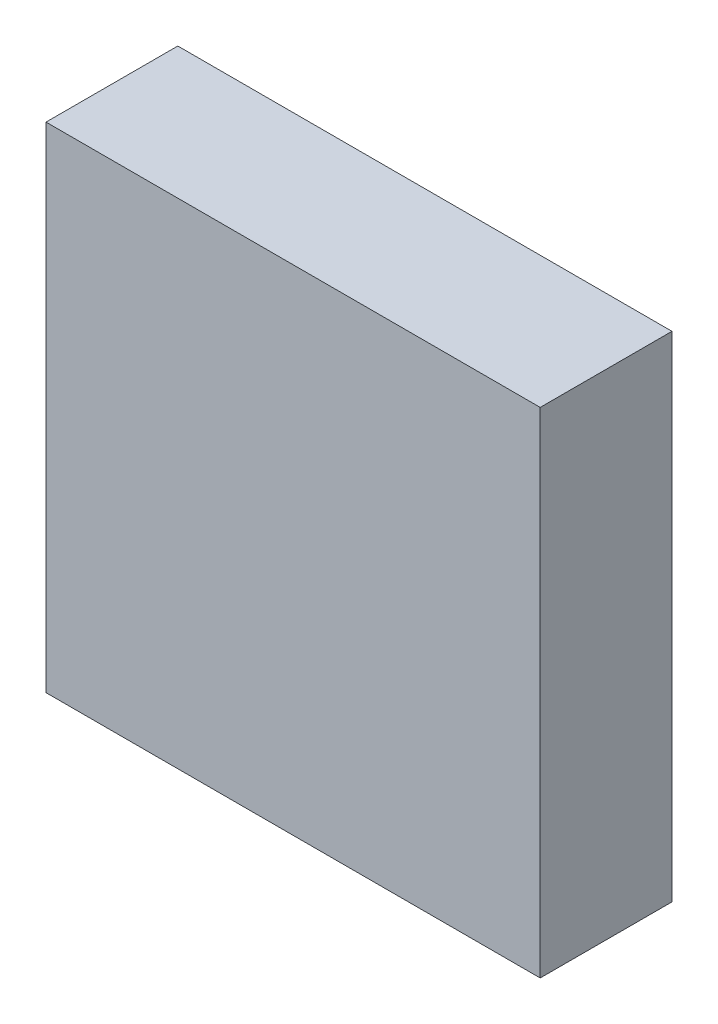
ISO-10303-21;
HEADER;
FILE_DESCRIPTION(('STEP AP214'),'2;1');
FILE_NAME('part.step','',(''),(''),'','','');
FILE_SCHEMA(('AUTOMOTIVE_DESIGN { 1 0 10303 214 1 1 1 1 }'));
ENDSEC;
DATA;
#1=APPLICATION_CONTEXT('core data for automotive mechanical design processes');
#2=APPLICATION_PROTOCOL_DEFINITION('international standard','automotive_design',2000,#1);
#3=PRODUCT_CONTEXT('',#1,'mechanical');
#4=PRODUCT('Part','Part','',(#3));
#5=PRODUCT_RELATED_PRODUCT_CATEGORY('part','',(#4));
#6=PRODUCT_DEFINITION_FORMATION('','',#4);
#7=PRODUCT_DEFINITION_CONTEXT('part definition',#1,'design');
#8=PRODUCT_DEFINITION('design','',#6,#7);
#9=PRODUCT_DEFINITION_SHAPE('','',#8);
#10=(LENGTH_UNIT() NAMED_UNIT(*) SI_UNIT(.MILLI.,.METRE.));
#11=(NAMED_UNIT(*) PLANE_ANGLE_UNIT() SI_UNIT($,.RADIAN.));
#12=(NAMED_UNIT(*) SI_UNIT($,.STERADIAN.) SOLID_ANGLE_UNIT());
#13=UNCERTAINTY_MEASURE_WITH_UNIT(LENGTH_MEASURE(1.E-05),#10,'distance_accuracy_value','');
#14=(GEOMETRIC_REPRESENTATION_CONTEXT(3) GLOBAL_UNCERTAINTY_ASSIGNED_CONTEXT((#13)) GLOBAL_UNIT_ASSIGNED_CONTEXT((#10,
#11,#12)) REPRESENTATION_CONTEXT('',''));
#15=CARTESIAN_POINT('',(0.,0.,0.));
#16=DIRECTION('',(0.,0.,1.));
#17=DIRECTION('',(1.,0.,0.));
#18=AXIS2_PLACEMENT_3D('',#15,#16,#17);
#19=CARTESIAN_POINT('',(0.,0.,40.));
#20=DIRECTION('',(1.,0.,0.));
#21=DIRECTION('',(0.,0.,-1.));
#22=AXIS2_PLACEMENT_3D('',#19,#20,#21);
#23=PLANE('',#22);
#24=DIRECTION('',(0.,-1.,0.));
#25=VECTOR('',#24,1.);
#26=CARTESIAN_POINT('',(0.,0.,0.));
#27=LINE('',#26,#25);
#28=CARTESIAN_POINT('',(0.,150.,0.));
#29=VERTEX_POINT('',#28);
#30=CARTESIAN_POINT('',(0.,0.,0.));
#31=VERTEX_POINT('',#30);
#32=EDGE_CURVE('E107',#29,#31,#27,.T.);
#33=ORIENTED_EDGE('',*,*,#32,.T.);
#34=DIRECTION('',(0.,0.,-1.));
#35=VECTOR('',#34,1.);
#36=CARTESIAN_POINT('',(0.,0.,40.));
#37=LINE('',#36,#35);
#38=CARTESIAN_POINT('',(0.,0.,40.));
#39=VERTEX_POINT('',#38);
#40=EDGE_CURVE('E11',#39,#31,#37,.T.);
#41=ORIENTED_EDGE('',*,*,#40,.F.);
#42=DIRECTION('',(0.,-1.,0.));
#43=VECTOR('',#42,1.);
#44=CARTESIAN_POINT('',(0.,0.,40.));
#45=LINE('',#44,#43);
#46=CARTESIAN_POINT('',(0.,150.,40.));
#47=VERTEX_POINT('',#46);
#48=EDGE_CURVE('E91',#47,#39,#45,.T.);
#49=ORIENTED_EDGE('',*,*,#48,.F.);
#50=DIRECTION('',(0.,0.,-1.));
#51=VECTOR('',#50,1.);
#52=CARTESIAN_POINT('',(0.,150.,40.));
#53=LINE('',#52,#51);
#54=EDGE_CURVE('E103',#47,#29,#53,.T.);
#55=ORIENTED_EDGE('',*,*,#54,.T.);
#56=EDGE_LOOP('',(#33,#41,#49,#55));
#57=FACE_BOUND('',#56,.T.);
#58=ADVANCED_FACE('F39',(#57),#23,.F.);
#59=CARTESIAN_POINT('',(0.,0.,40.));
#60=DIRECTION('',(0.,1.,0.));
#61=DIRECTION('',(0.,0.,1.));
#62=AXIS2_PLACEMENT_3D('',#59,#60,#61);
#63=PLANE('',#62);
#64=DIRECTION('',(1.,0.,0.));
#65=VECTOR('',#64,1.);
#66=CARTESIAN_POINT('',(0.,0.,0.));
#67=LINE('',#66,#65);
#68=CARTESIAN_POINT('',(150.,0.,0.));
#69=VERTEX_POINT('',#68);
#70=EDGE_CURVE('E96',#31,#69,#67,.T.);
#71=ORIENTED_EDGE('',*,*,#70,.T.);
#72=DIRECTION('',(0.,0.,-1.));
#73=VECTOR('',#72,1.);
#74=CARTESIAN_POINT('',(150.,0.,40.));
#75=LINE('',#74,#73);
#76=CARTESIAN_POINT('',(150.,0.,40.));
#77=VERTEX_POINT('',#76);
#78=EDGE_CURVE('E48',#77,#69,#75,.T.);
#79=ORIENTED_EDGE('',*,*,#78,.F.);
#80=DIRECTION('',(1.,0.,0.));
#81=VECTOR('',#80,1.);
#82=CARTESIAN_POINT('',(0.,0.,40.));
#83=LINE('',#82,#81);
#84=EDGE_CURVE('E86',#39,#77,#83,.T.);
#85=ORIENTED_EDGE('',*,*,#84,.F.);
#86=ORIENTED_EDGE('',*,*,#40,.T.);
#87=EDGE_LOOP('',(#71,#79,#85,#86));
#88=FACE_BOUND('',#87,.T.);
#89=ADVANCED_FACE('F95',(#88),#63,.F.);
#90=CARTESIAN_POINT('',(150.,0.,40.));
#91=DIRECTION('',(-1.,0.,0.));
#92=DIRECTION('',(0.,0.,1.));
#93=AXIS2_PLACEMENT_3D('',#90,#91,#92);
#94=PLANE('',#93);
#95=DIRECTION('',(0.,1.,0.));
#96=VECTOR('',#95,1.);
#97=CARTESIAN_POINT('',(150.,0.,0.));
#98=LINE('',#97,#96);
#99=CARTESIAN_POINT('',(150.,150.,0.));
#100=VERTEX_POINT('',#99);
#101=EDGE_CURVE('E73',#69,#100,#98,.T.);
#102=ORIENTED_EDGE('',*,*,#101,.T.);
#103=DIRECTION('',(0.,0.,-1.));
#104=VECTOR('',#103,1.);
#105=CARTESIAN_POINT('',(150.,150.,40.));
#106=LINE('',#105,#104);
#107=CARTESIAN_POINT('',(150.,150.,40.));
#108=VERTEX_POINT('',#107);
#109=EDGE_CURVE('E98',#108,#100,#106,.T.);
#110=ORIENTED_EDGE('',*,*,#109,.F.);
#111=DIRECTION('',(0.,1.,0.));
#112=VECTOR('',#111,1.);
#113=CARTESIAN_POINT('',(150.,0.,40.));
#114=LINE('',#113,#112);
#115=EDGE_CURVE('E89',#77,#108,#114,.T.);
#116=ORIENTED_EDGE('',*,*,#115,.F.);
#117=ORIENTED_EDGE('',*,*,#78,.T.);
#118=EDGE_LOOP('',(#102,#110,#116,#117));
#119=FACE_BOUND('',#118,.T.);
#120=ADVANCED_FACE('F99',(#119),#94,.F.);
#121=CARTESIAN_POINT('',(0.,150.,40.));
#122=DIRECTION('',(0.,-1.,0.));
#123=DIRECTION('',(0.,0.,-1.));
#124=AXIS2_PLACEMENT_3D('',#121,#122,#123);
#125=PLANE('',#124);
#126=DIRECTION('',(-1.,0.,0.));
#127=VECTOR('',#126,1.);
#128=CARTESIAN_POINT('',(0.,150.,0.));
#129=LINE('',#128,#127);
#130=EDGE_CURVE('E79',#100,#29,#129,.T.);
#131=ORIENTED_EDGE('',*,*,#130,.T.);
#132=ORIENTED_EDGE('',*,*,#54,.F.);
#133=DIRECTION('',(-1.,0.,0.));
#134=VECTOR('',#133,1.);
#135=CARTESIAN_POINT('',(0.,150.,40.));
#136=LINE('',#135,#134);
#137=EDGE_CURVE('E56',#108,#47,#136,.T.);
#138=ORIENTED_EDGE('',*,*,#137,.F.);
#139=ORIENTED_EDGE('',*,*,#109,.T.);
#140=EDGE_LOOP('',(#131,#132,#138,#139));
#141=FACE_BOUND('',#140,.T.);
#142=ADVANCED_FACE('F120',(#141),#125,.F.);
#143=CARTESIAN_POINT('',(0.,0.,40.));
#144=DIRECTION('',(0.,0.,-1.));
#145=DIRECTION('',(-1.,0.,0.));
#146=AXIS2_PLACEMENT_3D('',#143,#144,#145);
#147=PLANE('',#146);
#148=ORIENTED_EDGE('',*,*,#48,.T.);
#149=ORIENTED_EDGE('',*,*,#84,.T.);
#150=ORIENTED_EDGE('',*,*,#115,.T.);
#151=ORIENTED_EDGE('',*,*,#137,.T.);
#152=EDGE_LOOP('',(#148,#149,#150,#151));
#153=FACE_BOUND('',#152,.T.);
#154=ADVANCED_FACE('F87',(#153),#147,.F.);
#155=CARTESIAN_POINT('',(0.,0.,0.));
#156=DIRECTION('',(0.,0.,-1.));
#157=DIRECTION('',(-1.,0.,0.));
#158=AXIS2_PLACEMENT_3D('',#155,#156,#157);
#159=PLANE('',#158);
#160=ORIENTED_EDGE('',*,*,#32,.F.);
#161=ORIENTED_EDGE('',*,*,#130,.F.);
#162=ORIENTED_EDGE('',*,*,#101,.F.);
#163=ORIENTED_EDGE('',*,*,#70,.F.);
#164=EDGE_LOOP('',(#160,#161,#162,#163));
#165=FACE_BOUND('',#164,.T.);
#166=ADVANCED_FACE('F123',(#165),#159,.T.);
#167=CLOSED_SHELL('',(#58,#89,#120,#142,#154,#166));
#168=MANIFOLD_SOLID_BREP('B2',#167);
#169=ADVANCED_BREP_SHAPE_REPRESENTATION('',(#18,#168),#14);
#170=SHAPE_DEFINITION_REPRESENTATION(#9,#169);
ENDSEC;
END-ISO-10303-21;
